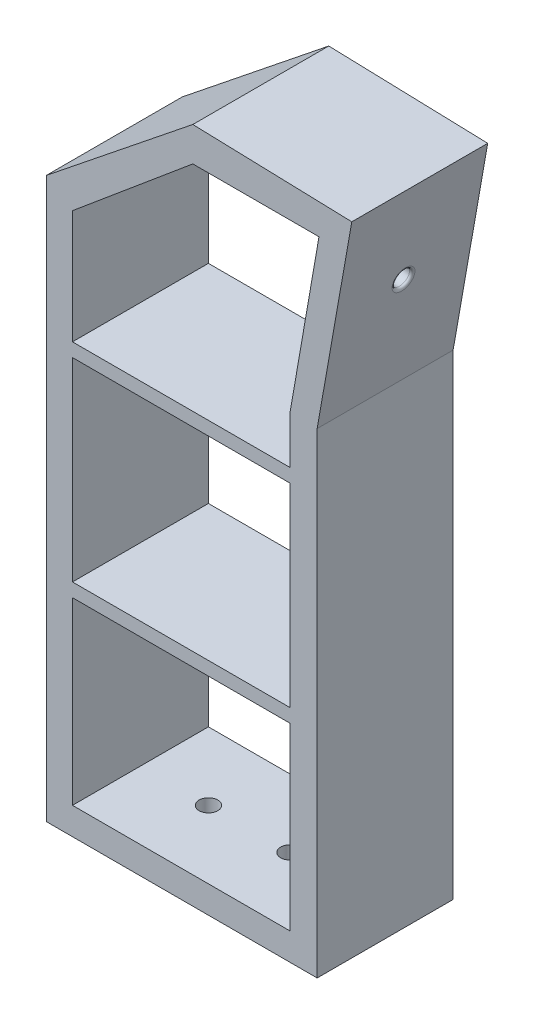
ISO-10303-21;
HEADER;
FILE_DESCRIPTION(('STEP AP214'),'2;1');
FILE_NAME('part.step','',(''),(''),'','','');
FILE_SCHEMA(('AUTOMOTIVE_DESIGN { 1 0 10303 214 1 1 1 1 }'));
ENDSEC;
DATA;
#1=APPLICATION_CONTEXT('core data for automotive mechanical design processes');
#2=APPLICATION_PROTOCOL_DEFINITION('international standard','automotive_design',2000,#1);
#3=PRODUCT_CONTEXT('',#1,'mechanical');
#4=PRODUCT('Part','Part','',(#3));
#5=PRODUCT_RELATED_PRODUCT_CATEGORY('part','',(#4));
#6=PRODUCT_DEFINITION_FORMATION('','',#4);
#7=PRODUCT_DEFINITION_CONTEXT('part definition',#1,'design');
#8=PRODUCT_DEFINITION('design','',#6,#7);
#9=PRODUCT_DEFINITION_SHAPE('','',#8);
#10=(LENGTH_UNIT() NAMED_UNIT(*) SI_UNIT(.MILLI.,.METRE.));
#11=(NAMED_UNIT(*) PLANE_ANGLE_UNIT() SI_UNIT($,.RADIAN.));
#12=(NAMED_UNIT(*) SI_UNIT($,.STERADIAN.) SOLID_ANGLE_UNIT());
#13=UNCERTAINTY_MEASURE_WITH_UNIT(LENGTH_MEASURE(1.E-05),#10,'distance_accuracy_value','');
#14=(GEOMETRIC_REPRESENTATION_CONTEXT(3) GLOBAL_UNCERTAINTY_ASSIGNED_CONTEXT((#13)) GLOBAL_UNIT_ASSIGNED_CONTEXT((#10,
#11,#12)) REPRESENTATION_CONTEXT('',''));
#15=CARTESIAN_POINT('',(0.,0.,0.));
#16=DIRECTION('',(0.,0.,1.));
#17=DIRECTION('',(1.,0.,0.));
#18=AXIS2_PLACEMENT_3D('',#15,#16,#17);
#19=CARTESIAN_POINT('',(64.9184451935931,213.581150545143,25.));
#20=DIRECTION('',(-0.984807753012208,0.17364817766693,0.));
#21=DIRECTION('',(-0.17364817766693,-0.984807753012208,0.));
#22=AXIS2_PLACEMENT_3D('',#19,#20,#21);
#23=TOROIDAL_SURFACE('',#22,4.15,1.);
#24=CARTESIAN_POINT('',(64.9184451935931,213.581150545143,25.));
#25=DIRECTION('',(-0.984807753012208,0.17364817766693,0.));
#26=DIRECTION('',(-0.17364817766693,-0.984807753012208,0.));
#27=AXIS2_PLACEMENT_3D('',#24,#25,#26);
#28=CIRCLE('',#27,3.15);
#29=CARTESIAN_POINT('',(64.3714534339422,210.479006123155,25.));
#30=VERTEX_POINT('',#29);
#31=EDGE_CURVE('E51',#30,#30,#28,.F.);
#32=ORIENTED_EDGE('',*,*,#31,.F.);
#33=EDGE_LOOP('',(#32));
#34=FACE_BOUND('',#33,.T.);
#35=CARTESIAN_POINT('',(65.9032529466053,213.407502367476,25.));
#36=DIRECTION('',(-0.984807753012208,0.17364817766693,0.));
#37=DIRECTION('',(-0.17364817766693,-0.984807753012208,0.));
#38=AXIS2_PLACEMENT_3D('',#35,#36,#37);
#39=CIRCLE('',#38,4.15);
#40=CARTESIAN_POINT('',(65.1826130092875,209.320550192476,25.));
#41=VERTEX_POINT('',#40);
#42=EDGE_CURVE('E11',#41,#41,#39,.T.);
#43=ORIENTED_EDGE('',*,*,#42,.F.);
#44=EDGE_LOOP('',(#43));
#45=FACE_BOUND('',#44,.T.);
#46=ADVANCED_FACE('F43',(#34,#45),#23,.T.);
#47=CARTESIAN_POINT('',(-30.8690259824049,107.98972636841,50.));
#48=DIRECTION('',(1.,0.,0.));
#49=DIRECTION('',(0.,1.,0.));
#50=AXIS2_PLACEMENT_3D('',#47,#48,#49);
#51=PLANE('',#50);
#52=DIRECTION('',(0.,0.,1.));
#53=VECTOR('',#52,1.);
#54=CARTESIAN_POINT('',(-30.869025982405,81.1512971011657,0.));
#55=LINE('',#54,#53);
#56=CARTESIAN_POINT('',(-30.8690259824049,81.1512971011657,0.));
#57=VERTEX_POINT('',#56);
#58=CARTESIAN_POINT('',(-30.8690259824049,81.1512971011657,50.));
#59=VERTEX_POINT('',#58);
#60=EDGE_CURVE('E66',#57,#59,#55,.T.);
#61=ORIENTED_EDGE('',*,*,#60,.F.);
#62=DIRECTION('',(0.,-1.,0.));
#63=VECTOR('',#62,1.);
#64=CARTESIAN_POINT('',(-30.8690259824049,107.98972636841,0.));
#65=LINE('',#64,#63);
#66=CARTESIAN_POINT('',(-30.8690259824049,152.635730725864,0.));
#67=VERTEX_POINT('',#66);
#68=EDGE_CURVE('E293',#67,#57,#65,.T.);
#69=ORIENTED_EDGE('',*,*,#68,.F.);
#70=DIRECTION('',(0.,0.,1.));
#71=VECTOR('',#70,1.);
#72=CARTESIAN_POINT('',(-30.869025982405,152.635730725864,0.));
#73=LINE('',#72,#71);
#74=CARTESIAN_POINT('',(-30.869025982405,152.635730725864,50.));
#75=VERTEX_POINT('',#74);
#76=EDGE_CURVE('E232',#67,#75,#73,.T.);
#77=ORIENTED_EDGE('',*,*,#76,.T.);
#78=DIRECTION('',(0.,-1.,0.));
#79=VECTOR('',#78,1.);
#80=CARTESIAN_POINT('',(-30.8690259824049,107.98972636841,50.));
#81=LINE('',#80,#79);
#82=EDGE_CURVE('E272',#75,#59,#81,.T.);
#83=ORIENTED_EDGE('',*,*,#82,.T.);
#84=EDGE_LOOP('',(#61,#69,#77,#83));
#85=FACE_BOUND('',#84,.T.);
#86=ADVANCED_FACE('F409',(#85),#51,.T.);
#87=CARTESIAN_POINT('',(49.130974017595,87.5,50.));
#88=DIRECTION('',(-1.,0.,0.));
#89=DIRECTION('',(0.,-1.,0.));
#90=AXIS2_PLACEMENT_3D('',#87,#88,#89);
#91=PLANE('',#90);
#92=DIRECTION('',(0.,0.,1.));
#93=VECTOR('',#92,1.);
#94=CARTESIAN_POINT('',(49.130974017595,81.1512971011657,0.));
#95=LINE('',#94,#93);
#96=CARTESIAN_POINT('',(49.130974017595,81.1512971011657,0.));
#97=VERTEX_POINT('',#96);
#98=CARTESIAN_POINT('',(49.130974017595,81.1512971011657,50.));
#99=VERTEX_POINT('',#98);
#100=EDGE_CURVE('E197',#97,#99,#95,.T.);
#101=ORIENTED_EDGE('',*,*,#100,.T.);
#102=DIRECTION('',(0.,1.,0.));
#103=VECTOR('',#102,1.);
#104=CARTESIAN_POINT('',(49.130974017595,10.,50.));
#105=LINE('',#104,#103);
#106=CARTESIAN_POINT('',(49.1309740175949,152.635730725864,50.));
#107=VERTEX_POINT('',#106);
#108=EDGE_CURVE('E181',#99,#107,#105,.T.);
#109=ORIENTED_EDGE('',*,*,#108,.T.);
#110=DIRECTION('',(0.,0.,1.));
#111=VECTOR('',#110,1.);
#112=CARTESIAN_POINT('',(49.1309740175949,152.635730725864,0.));
#113=LINE('',#112,#111);
#114=CARTESIAN_POINT('',(49.1309740175949,152.635730725864,0.));
#115=VERTEX_POINT('',#114);
#116=EDGE_CURVE('E247',#115,#107,#113,.T.);
#117=ORIENTED_EDGE('',*,*,#116,.F.);
#118=DIRECTION('',(0.,1.,0.));
#119=VECTOR('',#118,1.);
#120=CARTESIAN_POINT('',(49.130974017595,87.5,0.));
#121=LINE('',#120,#119);
#122=EDGE_CURVE('E199',#97,#115,#121,.T.);
#123=ORIENTED_EDGE('',*,*,#122,.F.);
#124=EDGE_LOOP('',(#101,#109,#117,#123));
#125=FACE_BOUND('',#124,.T.);
#126=ADVANCED_FACE('F198',(#125),#91,.T.);
#127=DIRECTION('',(0.,0.,1.));
#128=VECTOR('',#127,1.);
#129=CARTESIAN_POINT('',(-30.869025982405,157.635730725864,0.));
#130=LINE('',#129,#128);
#131=CARTESIAN_POINT('',(-30.8690259824049,157.635730725864,0.));
#132=VERTEX_POINT('',#131);
#133=CARTESIAN_POINT('',(-30.869025982405,157.635730725864,50.));
#134=VERTEX_POINT('',#133);
#135=EDGE_CURVE('E238',#132,#134,#130,.T.);
#136=ORIENTED_EDGE('',*,*,#135,.F.);
#137=CARTESIAN_POINT('',(-30.869025982405,199.417263156936,0.));
#138=VERTEX_POINT('',#137);
#139=EDGE_CURVE('E288',#138,#132,#65,.T.);
#140=ORIENTED_EDGE('',*,*,#139,.F.);
#141=DIRECTION('',(0.,0.,-1.));
#142=VECTOR('',#141,1.);
#143=CARTESIAN_POINT('',(-30.869025982405,199.417263156936,50.));
#144=LINE('',#143,#142);
#145=CARTESIAN_POINT('',(-30.869025982405,199.417263156936,50.));
#146=VERTEX_POINT('',#145);
#147=EDGE_CURVE('E287',#146,#138,#144,.T.);
#148=ORIENTED_EDGE('',*,*,#147,.F.);
#149=EDGE_CURVE('E268',#146,#134,#81,.T.);
#150=ORIENTED_EDGE('',*,*,#149,.T.);
#151=EDGE_LOOP('',(#136,#140,#148,#150));
#152=FACE_BOUND('',#151,.T.);
#153=ADVANCED_FACE('F470',(#152),#51,.T.);
#154=DIRECTION('',(0.,0.,1.));
#155=VECTOR('',#154,1.);
#156=CARTESIAN_POINT('',(49.130974017595,157.635730725864,0.));
#157=LINE('',#156,#155);
#158=CARTESIAN_POINT('',(49.1309740175949,157.635730725864,0.));
#159=VERTEX_POINT('',#158);
#160=CARTESIAN_POINT('',(49.130974017595,157.635730725864,50.));
#161=VERTEX_POINT('',#160);
#162=EDGE_CURVE('E243',#159,#161,#157,.T.);
#163=ORIENTED_EDGE('',*,*,#162,.T.);
#164=CARTESIAN_POINT('',(49.1309740175949,175.,50.));
#165=VERTEX_POINT('',#164);
#166=EDGE_CURVE('E194',#161,#165,#105,.T.);
#167=ORIENTED_EDGE('',*,*,#166,.T.);
#168=DIRECTION('',(0.,0.,-1.));
#169=VECTOR('',#168,1.);
#170=CARTESIAN_POINT('',(49.1309740175949,175.,50.));
#171=LINE('',#170,#169);
#172=CARTESIAN_POINT('',(49.1309740175949,175.,0.));
#173=VERTEX_POINT('',#172);
#174=EDGE_CURVE('E324',#165,#173,#171,.T.);
#175=ORIENTED_EDGE('',*,*,#174,.T.);
#176=EDGE_CURVE('E297',#159,#173,#121,.T.);
#177=ORIENTED_EDGE('',*,*,#176,.F.);
#178=EDGE_LOOP('',(#163,#167,#175,#177));
#179=FACE_BOUND('',#178,.T.);
#180=ADVANCED_FACE('F465',(#179),#91,.T.);
#181=CARTESIAN_POINT('',(0.,0.,50.));
#182=DIRECTION('',(0.,0.,1.));
#183=DIRECTION('',(1.,0.,0.));
#184=AXIS2_PLACEMENT_3D('',#181,#182,#183);
#185=PLANE('',#184);
#186=CARTESIAN_POINT('',(-30.869025982405,76.1512971011657,50.));
#187=VERTEX_POINT('',#186);
#188=CARTESIAN_POINT('',(-30.869025982405,10.,50.));
#189=VERTEX_POINT('',#188);
#190=EDGE_CURVE('E273',#187,#189,#81,.T.);
#191=ORIENTED_EDGE('',*,*,#190,.F.);
#192=DIRECTION('',(1.,0.,0.));
#193=VECTOR('',#192,1.);
#194=CARTESIAN_POINT('',(49.130974017595,76.1512971011657,50.));
#195=LINE('',#194,#193);
#196=CARTESIAN_POINT('',(49.130974017595,76.1512971011657,50.));
#197=VERTEX_POINT('',#196);
#198=EDGE_CURVE('E208',#187,#197,#195,.T.);
#199=ORIENTED_EDGE('',*,*,#198,.T.);
#200=CARTESIAN_POINT('',(49.130974017595,10.,50.));
#201=VERTEX_POINT('',#200);
#202=EDGE_CURVE('E193',#201,#197,#105,.T.);
#203=ORIENTED_EDGE('',*,*,#202,.F.);
#204=DIRECTION('',(1.,0.,0.));
#205=VECTOR('',#204,1.);
#206=CARTESIAN_POINT('',(-30.869025982405,10.,50.));
#207=LINE('',#206,#205);
#208=EDGE_CURVE('E271',#189,#201,#207,.T.);
#209=ORIENTED_EDGE('',*,*,#208,.F.);
#210=EDGE_LOOP('',(#191,#199,#203,#209));
#211=FACE_BOUND('',#210,.T.);
#212=ORIENTED_EDGE('',*,*,#82,.F.);
#213=DIRECTION('',(1.,0.,0.));
#214=VECTOR('',#213,1.);
#215=CARTESIAN_POINT('',(49.1309740175949,152.635730725864,50.));
#216=LINE('',#215,#214);
#217=EDGE_CURVE('E188',#75,#107,#216,.T.);
#218=ORIENTED_EDGE('',*,*,#217,.T.);
#219=ORIENTED_EDGE('',*,*,#108,.F.);
#220=DIRECTION('',(-1.,0.,0.));
#221=VECTOR('',#220,1.);
#222=CARTESIAN_POINT('',(-30.869025982405,81.1512971011657,50.));
#223=LINE('',#222,#221);
#224=EDGE_CURVE('E186',#99,#59,#223,.T.);
#225=ORIENTED_EDGE('',*,*,#224,.T.);
#226=EDGE_LOOP('',(#212,#218,#219,#225));
#227=FACE_BOUND('',#226,.T.);
#228=DIRECTION('',(0.17364817766693,0.984807753012208,0.));
#229=VECTOR('',#228,1.);
#230=CARTESIAN_POINT('',(59.130974017595,175.,50.));
#231=LINE('',#230,#229);
#232=CARTESIAN_POINT('',(59.130974017595,175.,50.));
#233=VERTEX_POINT('',#232);
#234=CARTESIAN_POINT('',(71.8700104345077,247.246665630685,50.));
#235=VERTEX_POINT('',#234);
#236=EDGE_CURVE('E336',#233,#235,#231,.T.);
#237=ORIENTED_EDGE('',*,*,#236,.T.);
#238=DIRECTION('',(-0.999548379008558,0.0300505910318502,0.));
#239=VECTOR('',#238,1.);
#240=CARTESIAN_POINT('',(71.8700104345077,247.246665630685,50.));
#241=LINE('',#240,#239);
#242=CARTESIAN_POINT('',(13.3973157687748,249.004598584038,50.));
#243=VERTEX_POINT('',#242);
#244=EDGE_CURVE('E340',#235,#243,#241,.T.);
#245=ORIENTED_EDGE('',*,*,#244,.T.);
#246=DIRECTION('',(-0.780498384907801,-0.625157797005136,0.));
#247=VECTOR('',#246,1.);
#248=CARTESIAN_POINT('',(13.3973157687748,249.004598584038,50.));
#249=LINE('',#248,#247);
#250=CARTESIAN_POINT('',(-40.5064857593433,205.829132157543,50.));
#251=VERTEX_POINT('',#250);
#252=EDGE_CURVE('E344',#243,#251,#249,.T.);
#253=ORIENTED_EDGE('',*,*,#252,.T.);
#254=DIRECTION('',(0.,-1.,0.));
#255=VECTOR('',#254,1.);
#256=CARTESIAN_POINT('',(-40.5064857593433,205.829132157543,50.));
#257=LINE('',#256,#255);
#258=CARTESIAN_POINT('',(-40.5064857593433,0.,50.));
#259=VERTEX_POINT('',#258);
#260=EDGE_CURVE('E347',#251,#259,#257,.T.);
#261=ORIENTED_EDGE('',*,*,#260,.T.);
#262=DIRECTION('',(1.,0.,0.));
#263=VECTOR('',#262,1.);
#264=CARTESIAN_POINT('',(-40.5064857593433,0.,50.));
#265=LINE('',#264,#263);
#266=CARTESIAN_POINT('',(59.130974017595,0.,50.));
#267=VERTEX_POINT('',#266);
#268=EDGE_CURVE('E350',#259,#267,#265,.T.);
#269=ORIENTED_EDGE('',*,*,#268,.T.);
#270=DIRECTION('',(0.,1.,0.));
#271=VECTOR('',#270,1.);
#272=CARTESIAN_POINT('',(59.130974017595,0.,50.));
#273=LINE('',#272,#271);
#274=EDGE_CURVE('E353',#267,#233,#273,.T.);
#275=ORIENTED_EDGE('',*,*,#274,.T.);
#276=EDGE_LOOP('',(#237,#245,#253,#261,#269,#275));
#277=FACE_BOUND('',#276,.T.);
#278=DIRECTION('',(-1.,0.,0.));
#279=VECTOR('',#278,1.);
#280=CARTESIAN_POINT('',(-30.869025982405,157.635730725864,50.));
#281=LINE('',#280,#279);
#282=EDGE_CURVE('E228',#161,#134,#281,.T.);
#283=ORIENTED_EDGE('',*,*,#282,.T.);
#284=ORIENTED_EDGE('',*,*,#149,.F.);
#285=DIRECTION('',(-0.767024540953393,-0.641617762827088,0.));
#286=VECTOR('',#285,1.);
#287=CARTESIAN_POINT('',(6.25157797005136,230.468732296582,50.));
#288=LINE('',#287,#286);
#289=CARTESIAN_POINT('',(13.3973157687748,236.446158122446,50.));
#290=VERTEX_POINT('',#289);
#291=EDGE_CURVE('E284',#290,#146,#288,.T.);
#292=ORIENTED_EDGE('',*,*,#291,.F.);
#293=DIRECTION('',(-1.,0.,0.));
#294=VECTOR('',#293,1.);
#295=CARTESIAN_POINT('',(59.8009874001918,236.446158122446,50.));
#296=LINE('',#295,#294);
#297=CARTESIAN_POINT('',(59.8009874001918,236.446158122446,50.));
#298=VERTEX_POINT('',#297);
#299=EDGE_CURVE('E280',#298,#290,#296,.T.);
#300=ORIENTED_EDGE('',*,*,#299,.F.);
#301=DIRECTION('',(0.171087869746036,0.985255774317392,0.));
#302=VECTOR('',#301,1.);
#303=CARTESIAN_POINT('',(59.1309740175949,232.587704831436,50.));
#304=LINE('',#303,#302);
#305=EDGE_CURVE('E277',#165,#298,#304,.T.);
#306=ORIENTED_EDGE('',*,*,#305,.F.);
#307=ORIENTED_EDGE('',*,*,#166,.F.);
#308=EDGE_LOOP('',(#283,#284,#292,#300,#306,#307));
#309=FACE_BOUND('',#308,.T.);
#310=ADVANCED_FACE('F183',(#211,#227,#277,#309),#185,.T.);
#311=CARTESIAN_POINT('',(0.,0.,0.));
#312=DIRECTION('',(0.,0.,1.));
#313=DIRECTION('',(1.,0.,0.));
#314=AXIS2_PLACEMENT_3D('',#311,#312,#313);
#315=PLANE('',#314);
#316=DIRECTION('',(1.,0.,0.));
#317=VECTOR('',#316,1.);
#318=CARTESIAN_POINT('',(49.130974017595,76.1512971011657,0.));
#319=LINE('',#318,#317);
#320=CARTESIAN_POINT('',(-30.8690259824049,76.1512971011657,0.));
#321=VERTEX_POINT('',#320);
#322=CARTESIAN_POINT('',(49.130974017595,76.1512971011657,0.));
#323=VERTEX_POINT('',#322);
#324=EDGE_CURVE('E209',#321,#323,#319,.T.);
#325=ORIENTED_EDGE('',*,*,#324,.F.);
#326=CARTESIAN_POINT('',(-30.869025982405,10.,0.));
#327=VERTEX_POINT('',#326);
#328=EDGE_CURVE('E58',#321,#327,#65,.T.);
#329=ORIENTED_EDGE('',*,*,#328,.T.);
#330=DIRECTION('',(1.,0.,0.));
#331=VECTOR('',#330,1.);
#332=CARTESIAN_POINT('',(0.,10.,0.));
#333=LINE('',#332,#331);
#334=CARTESIAN_POINT('',(49.130974017595,10.,0.));
#335=VERTEX_POINT('',#334);
#336=EDGE_CURVE('E292',#327,#335,#333,.T.);
#337=ORIENTED_EDGE('',*,*,#336,.T.);
#338=EDGE_CURVE('E298',#335,#323,#121,.T.);
#339=ORIENTED_EDGE('',*,*,#338,.T.);
#340=EDGE_LOOP('',(#325,#329,#337,#339));
#341=FACE_BOUND('',#340,.T.);
#342=DIRECTION('',(1.,0.,0.));
#343=VECTOR('',#342,1.);
#344=CARTESIAN_POINT('',(49.1309740175949,152.635730725864,0.));
#345=LINE('',#344,#343);
#346=EDGE_CURVE('E223',#67,#115,#345,.T.);
#347=ORIENTED_EDGE('',*,*,#346,.F.);
#348=ORIENTED_EDGE('',*,*,#68,.T.);
#349=DIRECTION('',(-1.,0.,0.));
#350=VECTOR('',#349,1.);
#351=CARTESIAN_POINT('',(-30.869025982405,81.1512971011657,0.));
#352=LINE('',#351,#350);
#353=EDGE_CURVE('E216',#97,#57,#352,.T.);
#354=ORIENTED_EDGE('',*,*,#353,.F.);
#355=ORIENTED_EDGE('',*,*,#122,.T.);
#356=EDGE_LOOP('',(#347,#348,#354,#355));
#357=FACE_BOUND('',#356,.T.);
#358=DIRECTION('',(0.17364817766693,0.984807753012208,0.));
#359=VECTOR('',#358,1.);
#360=CARTESIAN_POINT('',(59.130974017595,175.,0.));
#361=LINE('',#360,#359);
#362=CARTESIAN_POINT('',(59.130974017595,175.,0.));
#363=VERTEX_POINT('',#362);
#364=CARTESIAN_POINT('',(71.8700104345077,247.246665630685,0.));
#365=VERTEX_POINT('',#364);
#366=EDGE_CURVE('E335',#363,#365,#361,.T.);
#367=ORIENTED_EDGE('',*,*,#366,.F.);
#368=DIRECTION('',(0.,1.,0.));
#369=VECTOR('',#368,1.);
#370=CARTESIAN_POINT('',(59.130974017595,0.,0.));
#371=LINE('',#370,#369);
#372=CARTESIAN_POINT('',(59.130974017595,0.,0.));
#373=VERTEX_POINT('',#372);
#374=EDGE_CURVE('E341',#373,#363,#371,.T.);
#375=ORIENTED_EDGE('',*,*,#374,.F.);
#376=DIRECTION('',(1.,0.,0.));
#377=VECTOR('',#376,1.);
#378=CARTESIAN_POINT('',(-40.5064857593433,0.,0.));
#379=LINE('',#378,#377);
#380=CARTESIAN_POINT('',(-40.5064857593433,0.,0.));
#381=VERTEX_POINT('',#380);
#382=EDGE_CURVE('E369',#381,#373,#379,.T.);
#383=ORIENTED_EDGE('',*,*,#382,.F.);
#384=DIRECTION('',(0.,-1.,0.));
#385=VECTOR('',#384,1.);
#386=CARTESIAN_POINT('',(-40.5064857593433,205.829132157543,0.));
#387=LINE('',#386,#385);
#388=CARTESIAN_POINT('',(-40.5064857593433,205.829132157543,0.));
#389=VERTEX_POINT('',#388);
#390=EDGE_CURVE('E366',#389,#381,#387,.T.);
#391=ORIENTED_EDGE('',*,*,#390,.F.);
#392=DIRECTION('',(-0.780498384907801,-0.625157797005136,0.));
#393=VECTOR('',#392,1.);
#394=CARTESIAN_POINT('',(13.3973157687748,249.004598584038,0.));
#395=LINE('',#394,#393);
#396=CARTESIAN_POINT('',(13.3973157687748,249.004598584038,0.));
#397=VERTEX_POINT('',#396);
#398=EDGE_CURVE('E363',#397,#389,#395,.T.);
#399=ORIENTED_EDGE('',*,*,#398,.F.);
#400=DIRECTION('',(-0.999548379008558,0.0300505910318502,0.));
#401=VECTOR('',#400,1.);
#402=CARTESIAN_POINT('',(71.8700104345077,247.246665630685,0.));
#403=LINE('',#402,#401);
#404=EDGE_CURVE('E360',#365,#397,#403,.T.);
#405=ORIENTED_EDGE('',*,*,#404,.F.);
#406=EDGE_LOOP('',(#367,#375,#383,#391,#399,#405));
#407=FACE_BOUND('',#406,.T.);
#408=ORIENTED_EDGE('',*,*,#139,.T.);
#409=DIRECTION('',(-1.,0.,0.));
#410=VECTOR('',#409,1.);
#411=CARTESIAN_POINT('',(-30.869025982405,157.635730725864,0.));
#412=LINE('',#411,#410);
#413=EDGE_CURVE('E227',#159,#132,#412,.T.);
#414=ORIENTED_EDGE('',*,*,#413,.F.);
#415=ORIENTED_EDGE('',*,*,#176,.T.);
#416=DIRECTION('',(0.171087869746036,0.985255774317392,0.));
#417=VECTOR('',#416,1.);
#418=CARTESIAN_POINT('',(59.1309740175949,232.587704831436,0.));
#419=LINE('',#418,#417);
#420=CARTESIAN_POINT('',(59.8009874001918,236.446158122446,0.));
#421=VERTEX_POINT('',#420);
#422=EDGE_CURVE('E302',#173,#421,#419,.T.);
#423=ORIENTED_EDGE('',*,*,#422,.T.);
#424=DIRECTION('',(-1.,0.,0.));
#425=VECTOR('',#424,1.);
#426=CARTESIAN_POINT('',(42.6336631016412,236.446158122446,0.));
#427=LINE('',#426,#425);
#428=CARTESIAN_POINT('',(13.3973157687748,236.446158122446,0.));
#429=VERTEX_POINT('',#428);
#430=EDGE_CURVE('E306',#421,#429,#427,.T.);
#431=ORIENTED_EDGE('',*,*,#430,.T.);
#432=DIRECTION('',(-0.767024540953393,-0.641617762827088,0.));
#433=VECTOR('',#432,1.);
#434=CARTESIAN_POINT('',(-30.869025982405,199.417263156936,0.));
#435=LINE('',#434,#433);
#436=EDGE_CURVE('E310',#429,#138,#435,.T.);
#437=ORIENTED_EDGE('',*,*,#436,.T.);
#438=EDGE_LOOP('',(#408,#414,#415,#423,#431,#437));
#439=FACE_BOUND('',#438,.T.);
#440=ADVANCED_FACE('F416',(#341,#357,#407,#439),#315,.F.);
#441=CARTESIAN_POINT('',(59.130974017595,175.,50.));
#442=DIRECTION('',(-0.984807753012208,0.17364817766693,0.));
#443=DIRECTION('',(-0.17364817766693,-0.984807753012208,0.));
#444=AXIS2_PLACEMENT_3D('',#441,#442,#443);
#445=PLANE('',#444);
#446=ORIENTED_EDGE('',*,*,#42,.T.);
#447=EDGE_LOOP('',(#446));
#448=FACE_BOUND('',#447,.T.);
#449=ORIENTED_EDGE('',*,*,#366,.T.);
#450=DIRECTION('',(0.,0.,-1.));
#451=VECTOR('',#450,1.);
#452=CARTESIAN_POINT('',(71.8700104345077,247.246665630685,50.));
#453=LINE('',#452,#451);
#454=EDGE_CURVE('E393',#235,#365,#453,.T.);
#455=ORIENTED_EDGE('',*,*,#454,.F.);
#456=ORIENTED_EDGE('',*,*,#236,.F.);
#457=DIRECTION('',(0.,0.,-1.));
#458=VECTOR('',#457,1.);
#459=CARTESIAN_POINT('',(59.130974017595,175.,50.));
#460=LINE('',#459,#458);
#461=EDGE_CURVE('E356',#233,#363,#460,.T.);
#462=ORIENTED_EDGE('',*,*,#461,.T.);
#463=EDGE_LOOP('',(#449,#455,#456,#462));
#464=FACE_BOUND('',#463,.T.);
#465=ADVANCED_FACE('F412',(#448,#464),#445,.F.);
#466=CARTESIAN_POINT('',(71.8700104345077,247.246665630685,50.));
#467=DIRECTION('',(-0.0300505910318502,-0.999548379008558,0.));
#468=DIRECTION('',(0.999548379008558,-0.0300505910318502,0.));
#469=AXIS2_PLACEMENT_3D('',#466,#467,#468);
#470=PLANE('',#469);
#471=ORIENTED_EDGE('',*,*,#404,.T.);
#472=DIRECTION('',(0.,0.,-1.));
#473=VECTOR('',#472,1.);
#474=CARTESIAN_POINT('',(13.3973157687748,249.004598584038,50.));
#475=LINE('',#474,#473);
#476=EDGE_CURVE('E389',#243,#397,#475,.T.);
#477=ORIENTED_EDGE('',*,*,#476,.F.);
#478=ORIENTED_EDGE('',*,*,#244,.F.);
#479=ORIENTED_EDGE('',*,*,#454,.T.);
#480=EDGE_LOOP('',(#471,#477,#478,#479));
#481=FACE_BOUND('',#480,.T.);
#482=ADVANCED_FACE('F415',(#481),#470,.F.);
#483=CARTESIAN_POINT('',(13.3973157687748,249.004598584038,50.));
#484=DIRECTION('',(0.625157797005136,-0.780498384907801,0.));
#485=DIRECTION('',(0.780498384907801,0.625157797005136,0.));
#486=AXIS2_PLACEMENT_3D('',#483,#484,#485);
#487=PLANE('',#486);
#488=ORIENTED_EDGE('',*,*,#398,.T.);
#489=DIRECTION('',(0.,0.,-1.));
#490=VECTOR('',#489,1.);
#491=CARTESIAN_POINT('',(-40.5064857593433,205.829132157543,50.));
#492=LINE('',#491,#490);
#493=EDGE_CURVE('E385',#251,#389,#492,.T.);
#494=ORIENTED_EDGE('',*,*,#493,.F.);
#495=ORIENTED_EDGE('',*,*,#252,.F.);
#496=ORIENTED_EDGE('',*,*,#476,.T.);
#497=EDGE_LOOP('',(#488,#494,#495,#496));
#498=FACE_BOUND('',#497,.T.);
#499=ADVANCED_FACE('F444',(#498),#487,.F.);
#500=CARTESIAN_POINT('',(-40.5064857593433,205.829132157543,50.));
#501=DIRECTION('',(1.,0.,0.));
#502=DIRECTION('',(0.,1.,0.));
#503=AXIS2_PLACEMENT_3D('',#500,#501,#502);
#504=PLANE('',#503);
#505=ORIENTED_EDGE('',*,*,#390,.T.);
#506=DIRECTION('',(0.,0.,-1.));
#507=VECTOR('',#506,1.);
#508=CARTESIAN_POINT('',(-40.5064857593433,0.,50.));
#509=LINE('',#508,#507);
#510=EDGE_CURVE('E381',#259,#381,#509,.T.);
#511=ORIENTED_EDGE('',*,*,#510,.F.);
#512=ORIENTED_EDGE('',*,*,#260,.F.);
#513=ORIENTED_EDGE('',*,*,#493,.T.);
#514=EDGE_LOOP('',(#505,#511,#512,#513));
#515=FACE_BOUND('',#514,.T.);
#516=ADVANCED_FACE('F440',(#515),#504,.F.);
#517=CARTESIAN_POINT('',(-40.5064857593433,0.,50.));
#518=DIRECTION('',(0.,1.,0.));
#519=DIRECTION('',(-1.,0.,0.));
#520=AXIS2_PLACEMENT_3D('',#517,#518,#519);
#521=PLANE('',#520);
#522=CARTESIAN_POINT('',(-5.85128713251137,0.,25.));
#523=DIRECTION('',(0.,1.,0.));
#524=DIRECTION('',(0.,0.,1.));
#525=AXIS2_PLACEMENT_3D('',#522,#523,#524);
#526=CIRCLE('',#525,3.425);
#527=CARTESIAN_POINT('',(-5.85128713251137,0.,28.425));
#528=VERTEX_POINT('',#527);
#529=EDGE_CURVE('E253',#528,#528,#526,.T.);
#530=ORIENTED_EDGE('',*,*,#529,.T.);
#531=EDGE_LOOP('',(#530));
#532=FACE_BOUND('',#531,.T.);
#533=CARTESIAN_POINT('',(24.130974017595,0.,25.));
#534=DIRECTION('',(0.,1.,0.));
#535=DIRECTION('',(0.,0.,1.));
#536=AXIS2_PLACEMENT_3D('',#533,#534,#535);
#537=CIRCLE('',#536,3.425);
#538=CARTESIAN_POINT('',(24.130974017595,0.,28.425));
#539=VERTEX_POINT('',#538);
#540=EDGE_CURVE('E242',#539,#539,#537,.T.);
#541=ORIENTED_EDGE('',*,*,#540,.T.);
#542=EDGE_LOOP('',(#541));
#543=FACE_BOUND('',#542,.T.);
#544=ORIENTED_EDGE('',*,*,#382,.T.);
#545=DIRECTION('',(0.,0.,-1.));
#546=VECTOR('',#545,1.);
#547=CARTESIAN_POINT('',(59.130974017595,0.,50.));
#548=LINE('',#547,#546);
#549=EDGE_CURVE('E377',#267,#373,#548,.T.);
#550=ORIENTED_EDGE('',*,*,#549,.F.);
#551=ORIENTED_EDGE('',*,*,#268,.F.);
#552=ORIENTED_EDGE('',*,*,#510,.T.);
#553=EDGE_LOOP('',(#544,#550,#551,#552));
#554=FACE_BOUND('',#553,.T.);
#555=ADVANCED_FACE('F437',(#532,#543,#554),#521,.F.);
#556=CARTESIAN_POINT('',(59.130974017595,0.,50.));
#557=DIRECTION('',(-1.,0.,0.));
#558=DIRECTION('',(0.,-1.,0.));
#559=AXIS2_PLACEMENT_3D('',#556,#557,#558);
#560=PLANE('',#559);
#561=ORIENTED_EDGE('',*,*,#374,.T.);
#562=ORIENTED_EDGE('',*,*,#461,.F.);
#563=ORIENTED_EDGE('',*,*,#274,.F.);
#564=ORIENTED_EDGE('',*,*,#549,.T.);
#565=EDGE_LOOP('',(#561,#562,#563,#564));
#566=FACE_BOUND('',#565,.T.);
#567=ADVANCED_FACE('F435',(#566),#560,.F.);
#568=DIRECTION('',(0.,0.,1.));
#569=VECTOR('',#568,1.);
#570=CARTESIAN_POINT('',(-30.869025982405,76.1512971011657,0.));
#571=LINE('',#570,#569);
#572=EDGE_CURVE('E221',#321,#187,#571,.T.);
#573=ORIENTED_EDGE('',*,*,#572,.T.);
#574=ORIENTED_EDGE('',*,*,#190,.T.);
#575=DIRECTION('',(0.,0.,-1.));
#576=VECTOR('',#575,1.);
#577=CARTESIAN_POINT('',(-30.869025982405,10.,50.));
#578=LINE('',#577,#576);
#579=EDGE_CURVE('E332',#189,#327,#578,.T.);
#580=ORIENTED_EDGE('',*,*,#579,.T.);
#581=ORIENTED_EDGE('',*,*,#328,.F.);
#582=EDGE_LOOP('',(#573,#574,#580,#581));
#583=FACE_BOUND('',#582,.T.);
#584=ADVANCED_FACE('F459',(#583),#51,.T.);
#585=CARTESIAN_POINT('',(0.,10.,50.));
#586=DIRECTION('',(0.,1.,0.));
#587=DIRECTION('',(0.,0.,1.));
#588=AXIS2_PLACEMENT_3D('',#585,#586,#587);
#589=PLANE('',#588);
#590=CARTESIAN_POINT('',(-5.85128713251137,10.,25.));
#591=DIRECTION('',(0.,1.,0.));
#592=DIRECTION('',(0.,0.,1.));
#593=AXIS2_PLACEMENT_3D('',#590,#591,#592);
#594=CIRCLE('',#593,3.425);
#595=CARTESIAN_POINT('',(-5.85128713251137,10.,28.425));
#596=VERTEX_POINT('',#595);
#597=EDGE_CURVE('E257',#596,#596,#594,.T.);
#598=ORIENTED_EDGE('',*,*,#597,.F.);
#599=EDGE_LOOP('',(#598));
#600=FACE_BOUND('',#599,.T.);
#601=CARTESIAN_POINT('',(24.130974017595,10.,25.));
#602=DIRECTION('',(0.,1.,0.));
#603=DIRECTION('',(0.,0.,1.));
#604=AXIS2_PLACEMENT_3D('',#601,#602,#603);
#605=CIRCLE('',#604,3.425);
#606=CARTESIAN_POINT('',(24.130974017595,10.,28.425));
#607=VERTEX_POINT('',#606);
#608=EDGE_CURVE('E261',#607,#607,#605,.T.);
#609=ORIENTED_EDGE('',*,*,#608,.F.);
#610=EDGE_LOOP('',(#609));
#611=FACE_BOUND('',#610,.T.);
#612=ORIENTED_EDGE('',*,*,#336,.F.);
#613=ORIENTED_EDGE('',*,*,#579,.F.);
#614=ORIENTED_EDGE('',*,*,#208,.T.);
#615=DIRECTION('',(0.,0.,-1.));
#616=VECTOR('',#615,1.);
#617=CARTESIAN_POINT('',(49.130974017595,10.,50.));
#618=LINE('',#617,#616);
#619=EDGE_CURVE('E328',#201,#335,#618,.T.);
#620=ORIENTED_EDGE('',*,*,#619,.T.);
#621=EDGE_LOOP('',(#612,#613,#614,#620));
#622=FACE_BOUND('',#621,.T.);
#623=ADVANCED_FACE('F469',(#600,#611,#622),#589,.T.);
#624=DIRECTION('',(0.,0.,1.));
#625=VECTOR('',#624,1.);
#626=CARTESIAN_POINT('',(49.130974017595,76.1512971011657,0.));
#627=LINE('',#626,#625);
#628=EDGE_CURVE('E204',#323,#197,#627,.T.);
#629=ORIENTED_EDGE('',*,*,#628,.F.);
#630=ORIENTED_EDGE('',*,*,#338,.F.);
#631=ORIENTED_EDGE('',*,*,#619,.F.);
#632=ORIENTED_EDGE('',*,*,#202,.T.);
#633=EDGE_LOOP('',(#629,#630,#631,#632));
#634=FACE_BOUND('',#633,.T.);
#635=ADVANCED_FACE('F473',(#634),#91,.T.);
#636=CARTESIAN_POINT('',(59.1309740175949,232.587704831436,50.));
#637=DIRECTION('',(-0.985255774317392,0.171087869746036,0.));
#638=DIRECTION('',(-0.171087869746036,-0.985255774317392,0.));
#639=AXIS2_PLACEMENT_3D('',#636,#637,#638);
#640=PLANE('',#639);
#641=CARTESIAN_POINT('',(56.1005154484751,215.135989473199,25.));
#642=DIRECTION('',(-0.985255774317392,0.171087869746036,0.));
#643=DIRECTION('',(-0.171087869746036,-0.985255774317392,0.));
#644=AXIS2_PLACEMENT_3D('',#641,#642,#643);
#645=ELLIPSE('',#644,3.15001064057804,3.15);
#646=CARTESIAN_POINT('',(55.5615868383013,212.032423300408,25.));
#647=VERTEX_POINT('',#646);
#648=EDGE_CURVE('E397',#647,#647,#645,.T.);
#649=ORIENTED_EDGE('',*,*,#648,.F.);
#650=EDGE_LOOP('',(#649));
#651=FACE_BOUND('',#650,.T.);
#652=ORIENTED_EDGE('',*,*,#422,.F.);
#653=ORIENTED_EDGE('',*,*,#174,.F.);
#654=ORIENTED_EDGE('',*,*,#305,.T.);
#655=DIRECTION('',(0.,0.,-1.));
#656=VECTOR('',#655,1.);
#657=CARTESIAN_POINT('',(59.8009874001918,236.446158122446,50.));
#658=LINE('',#657,#656);
#659=EDGE_CURVE('E320',#298,#421,#658,.T.);
#660=ORIENTED_EDGE('',*,*,#659,.T.);
#661=EDGE_LOOP('',(#652,#653,#654,#660));
#662=FACE_BOUND('',#661,.T.);
#663=ADVANCED_FACE('F477',(#651,#662),#640,.T.);
#664=CARTESIAN_POINT('',(42.6336631016412,236.446158122446,50.));
#665=DIRECTION('',(0.,-1.,0.));
#666=DIRECTION('',(0.,0.,-1.));
#667=AXIS2_PLACEMENT_3D('',#664,#665,#666);
#668=PLANE('',#667);
#669=ORIENTED_EDGE('',*,*,#430,.F.);
#670=ORIENTED_EDGE('',*,*,#659,.F.);
#671=ORIENTED_EDGE('',*,*,#299,.T.);
#672=DIRECTION('',(0.,0.,-1.));
#673=VECTOR('',#672,1.);
#674=CARTESIAN_POINT('',(13.3973157687748,236.446158122446,50.));
#675=LINE('',#674,#673);
#676=EDGE_CURVE('E316',#290,#429,#675,.T.);
#677=ORIENTED_EDGE('',*,*,#676,.T.);
#678=EDGE_LOOP('',(#669,#670,#671,#677));
#679=FACE_BOUND('',#678,.T.);
#680=ADVANCED_FACE('F481',(#679),#668,.T.);
#681=CARTESIAN_POINT('',(-30.869025982405,199.417263156936,50.));
#682=DIRECTION('',(0.641617762827088,-0.767024540953393,0.));
#683=DIRECTION('',(0.767024540953393,0.641617762827088,0.));
#684=AXIS2_PLACEMENT_3D('',#681,#682,#683);
#685=PLANE('',#684);
#686=ORIENTED_EDGE('',*,*,#436,.F.);
#687=ORIENTED_EDGE('',*,*,#676,.F.);
#688=ORIENTED_EDGE('',*,*,#291,.T.);
#689=ORIENTED_EDGE('',*,*,#147,.T.);
#690=EDGE_LOOP('',(#686,#687,#688,#689));
#691=FACE_BOUND('',#690,.T.);
#692=ADVANCED_FACE('F485',(#691),#685,.T.);
#693=CARTESIAN_POINT('',(24.130974017595,0.,25.));
#694=DIRECTION('',(0.,1.,0.));
#695=DIRECTION('',(0.,0.,1.));
#696=AXIS2_PLACEMENT_3D('',#693,#694,#695);
#697=CYLINDRICAL_SURFACE('',#696,3.425);
#698=ORIENTED_EDGE('',*,*,#540,.F.);
#699=EDGE_LOOP('',(#698));
#700=FACE_BOUND('',#699,.T.);
#701=ORIENTED_EDGE('',*,*,#608,.T.);
#702=EDGE_LOOP('',(#701));
#703=FACE_BOUND('',#702,.T.);
#704=ADVANCED_FACE('F489',(#700,#703),#697,.F.);
#705=CARTESIAN_POINT('',(-5.85128713251137,0.,25.));
#706=DIRECTION('',(0.,1.,0.));
#707=DIRECTION('',(0.,0.,1.));
#708=AXIS2_PLACEMENT_3D('',#705,#706,#707);
#709=CYLINDRICAL_SURFACE('',#708,3.425);
#710=ORIENTED_EDGE('',*,*,#529,.F.);
#711=EDGE_LOOP('',(#710));
#712=FACE_BOUND('',#711,.T.);
#713=ORIENTED_EDGE('',*,*,#597,.T.);
#714=EDGE_LOOP('',(#713));
#715=FACE_BOUND('',#714,.T.);
#716=ADVANCED_FACE('F493',(#712,#715),#709,.F.);
#717=CARTESIAN_POINT('',(-30.869025982405,157.635730725864,0.));
#718=DIRECTION('',(0.,1.,0.));
#719=DIRECTION('',(0.,0.,1.));
#720=AXIS2_PLACEMENT_3D('',#717,#718,#719);
#721=PLANE('',#720);
#722=ORIENTED_EDGE('',*,*,#282,.F.);
#723=ORIENTED_EDGE('',*,*,#162,.F.);
#724=ORIENTED_EDGE('',*,*,#413,.T.);
#725=ORIENTED_EDGE('',*,*,#135,.T.);
#726=EDGE_LOOP('',(#722,#723,#724,#725));
#727=FACE_BOUND('',#726,.T.);
#728=ADVANCED_FACE('F497',(#727),#721,.T.);
#729=CARTESIAN_POINT('',(49.1309740175949,152.635730725864,0.));
#730=DIRECTION('',(0.,-1.,0.));
#731=DIRECTION('',(0.,0.,-1.));
#732=AXIS2_PLACEMENT_3D('',#729,#730,#731);
#733=PLANE('',#732);
#734=ORIENTED_EDGE('',*,*,#217,.F.);
#735=ORIENTED_EDGE('',*,*,#76,.F.);
#736=ORIENTED_EDGE('',*,*,#346,.T.);
#737=ORIENTED_EDGE('',*,*,#116,.T.);
#738=EDGE_LOOP('',(#734,#735,#736,#737));
#739=FACE_BOUND('',#738,.T.);
#740=ADVANCED_FACE('F499',(#739),#733,.T.);
#741=CARTESIAN_POINT('',(-30.869025982405,81.1512971011657,0.));
#742=DIRECTION('',(0.,1.,0.));
#743=DIRECTION('',(0.,0.,1.));
#744=AXIS2_PLACEMENT_3D('',#741,#742,#743);
#745=PLANE('',#744);
#746=ORIENTED_EDGE('',*,*,#224,.F.);
#747=ORIENTED_EDGE('',*,*,#100,.F.);
#748=ORIENTED_EDGE('',*,*,#353,.T.);
#749=ORIENTED_EDGE('',*,*,#60,.T.);
#750=EDGE_LOOP('',(#746,#747,#748,#749));
#751=FACE_BOUND('',#750,.T.);
#752=ADVANCED_FACE('F206',(#751),#745,.T.);
#753=CARTESIAN_POINT('',(49.130974017595,76.1512971011657,0.));
#754=DIRECTION('',(0.,-1.,0.));
#755=DIRECTION('',(0.,0.,-1.));
#756=AXIS2_PLACEMENT_3D('',#753,#754,#755);
#757=PLANE('',#756);
#758=ORIENTED_EDGE('',*,*,#198,.F.);
#759=ORIENTED_EDGE('',*,*,#572,.F.);
#760=ORIENTED_EDGE('',*,*,#324,.T.);
#761=ORIENTED_EDGE('',*,*,#628,.T.);
#762=EDGE_LOOP('',(#758,#759,#760,#761));
#763=FACE_BOUND('',#762,.T.);
#764=ADVANCED_FACE('F508',(#763),#757,.T.);
#765=CARTESIAN_POINT('',(56.0551754164832,215.143984144145,25.));
#766=DIRECTION('',(0.984807753012208,-0.17364817766693,0.));
#767=DIRECTION('',(0.17364817766693,0.984807753012208,0.));
#768=AXIS2_PLACEMENT_3D('',#765,#766,#767);
#769=CYLINDRICAL_SURFACE('',#768,3.15);
#770=ORIENTED_EDGE('',*,*,#31,.T.);
#771=EDGE_LOOP('',(#770));
#772=FACE_BOUND('',#771,.T.);
#773=ORIENTED_EDGE('',*,*,#648,.T.);
#774=EDGE_LOOP('',(#773));
#775=FACE_BOUND('',#774,.T.);
#776=ADVANCED_FACE('F404',(#772,#775),#769,.F.);
#777=CLOSED_SHELL('',(#46,#86,#126,#153,#180,#310,#440,#465,#482,#499,#516,#555,#567,#584,#623,
#635,#663,#680,#692,#704,#716,#728,#740,#752,#764,#776));
#778=MANIFOLD_SOLID_BREP('B2',#777);
#779=ADVANCED_BREP_SHAPE_REPRESENTATION('',(#18,#778),#14);
#780=SHAPE_DEFINITION_REPRESENTATION(#9,#779);
ENDSEC;
END-ISO-10303-21;
